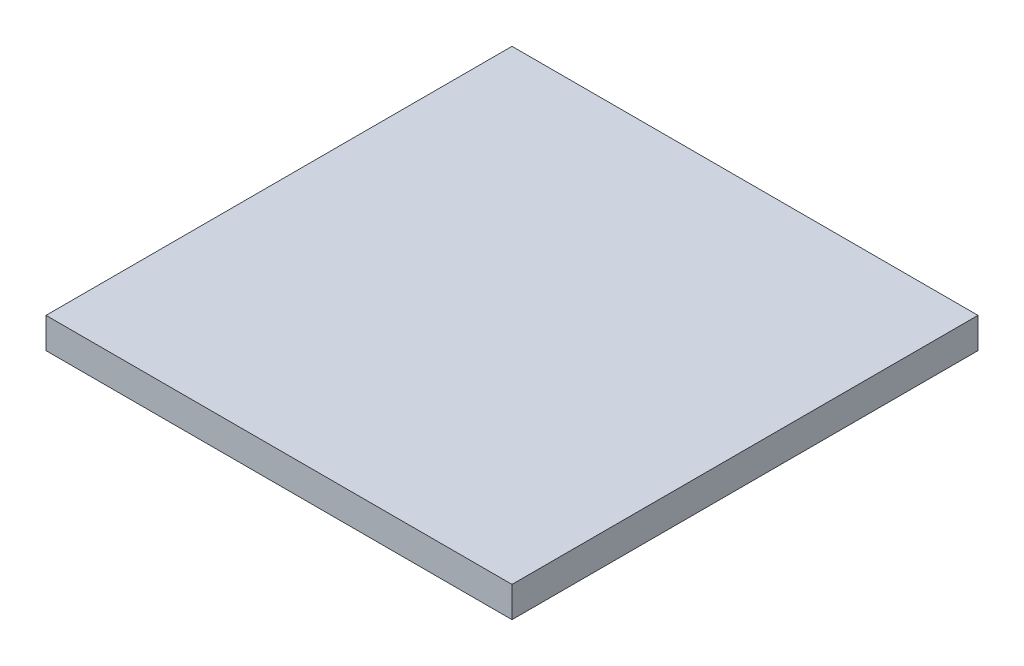
ISO-10303-21;
HEADER;
FILE_DESCRIPTION(('STEP AP214'),'2;1');
FILE_NAME('part.step','',(''),(''),'','','');
FILE_SCHEMA(('AUTOMOTIVE_DESIGN { 1 0 10303 214 1 1 1 1 }'));
ENDSEC;
DATA;
#1=APPLICATION_CONTEXT('core data for automotive mechanical design processes');
#2=APPLICATION_PROTOCOL_DEFINITION('international standard','automotive_design',2000,#1);
#3=PRODUCT_CONTEXT('',#1,'mechanical');
#4=PRODUCT('Part','Part','',(#3));
#5=PRODUCT_RELATED_PRODUCT_CATEGORY('part','',(#4));
#6=PRODUCT_DEFINITION_FORMATION('','',#4);
#7=PRODUCT_DEFINITION_CONTEXT('part definition',#1,'design');
#8=PRODUCT_DEFINITION('design','',#6,#7);
#9=PRODUCT_DEFINITION_SHAPE('','',#8);
#10=(LENGTH_UNIT() NAMED_UNIT(*) SI_UNIT(.MILLI.,.METRE.));
#11=(NAMED_UNIT(*) PLANE_ANGLE_UNIT() SI_UNIT($,.RADIAN.));
#12=(NAMED_UNIT(*) SI_UNIT($,.STERADIAN.) SOLID_ANGLE_UNIT());
#13=UNCERTAINTY_MEASURE_WITH_UNIT(LENGTH_MEASURE(1.E-05),#10,'distance_accuracy_value','');
#14=(GEOMETRIC_REPRESENTATION_CONTEXT(3) GLOBAL_UNCERTAINTY_ASSIGNED_CONTEXT((#13)) GLOBAL_UNIT_ASSIGNED_CONTEXT((#10,
#11,#12)) REPRESENTATION_CONTEXT('',''));
#15=CARTESIAN_POINT('',(0.,0.,0.));
#16=DIRECTION('',(0.,0.,1.));
#17=DIRECTION('',(1.,0.,0.));
#18=AXIS2_PLACEMENT_3D('',#15,#16,#17);
#19=CARTESIAN_POINT('',(76.2,10.,76.2));
#20=DIRECTION('',(-1.,0.,0.));
#21=DIRECTION('',(0.,0.,1.));
#22=AXIS2_PLACEMENT_3D('',#19,#20,#21);
#23=PLANE('',#22);
#24=DIRECTION('',(0.,0.,-1.));
#25=VECTOR('',#24,1.);
#26=CARTESIAN_POINT('',(76.2,0.,76.2));
#27=LINE('',#26,#25);
#28=CARTESIAN_POINT('',(76.2,0.,76.2));
#29=VERTEX_POINT('',#28);
#30=CARTESIAN_POINT('',(76.2,0.,-76.2));
#31=VERTEX_POINT('',#30);
#32=EDGE_CURVE('E100',#29,#31,#27,.T.);
#33=ORIENTED_EDGE('',*,*,#32,.T.);
#34=DIRECTION('',(0.,-1.,0.));
#35=VECTOR('',#34,1.);
#36=CARTESIAN_POINT('',(76.2,10.,-76.2));
#37=LINE('',#36,#35);
#38=CARTESIAN_POINT('',(76.2,10.,-76.2));
#39=VERTEX_POINT('',#38);
#40=EDGE_CURVE('E11',#39,#31,#37,.T.);
#41=ORIENTED_EDGE('',*,*,#40,.F.);
#42=DIRECTION('',(0.,0.,-1.));
#43=VECTOR('',#42,1.);
#44=CARTESIAN_POINT('',(76.2,10.,76.2));
#45=LINE('',#44,#43);
#46=CARTESIAN_POINT('',(76.2,10.,76.2));
#47=VERTEX_POINT('',#46);
#48=EDGE_CURVE('E88',#47,#39,#45,.T.);
#49=ORIENTED_EDGE('',*,*,#48,.F.);
#50=DIRECTION('',(0.,-1.,0.));
#51=VECTOR('',#50,1.);
#52=CARTESIAN_POINT('',(76.2,10.,76.2));
#53=LINE('',#52,#51);
#54=EDGE_CURVE('E96',#47,#29,#53,.T.);
#55=ORIENTED_EDGE('',*,*,#54,.T.);
#56=EDGE_LOOP('',(#33,#41,#49,#55));
#57=FACE_BOUND('',#56,.T.);
#58=ADVANCED_FACE('F37',(#57),#23,.F.);
#59=CARTESIAN_POINT('',(-76.2,10.,-76.2));
#60=DIRECTION('',(0.,0.,1.));
#61=DIRECTION('',(1.,0.,0.));
#62=AXIS2_PLACEMENT_3D('',#59,#60,#61);
#63=PLANE('',#62);
#64=DIRECTION('',(-1.,0.,0.));
#65=VECTOR('',#64,1.);
#66=CARTESIAN_POINT('',(-76.2,0.,-76.2));
#67=LINE('',#66,#65);
#68=CARTESIAN_POINT('',(-76.2,0.,-76.2));
#69=VERTEX_POINT('',#68);
#70=EDGE_CURVE('E92',#31,#69,#67,.T.);
#71=ORIENTED_EDGE('',*,*,#70,.T.);
#72=DIRECTION('',(0.,-1.,0.));
#73=VECTOR('',#72,1.);
#74=CARTESIAN_POINT('',(-76.2,10.,-76.2));
#75=LINE('',#74,#73);
#76=CARTESIAN_POINT('',(-76.2,10.,-76.2));
#77=VERTEX_POINT('',#76);
#78=EDGE_CURVE('E45',#77,#69,#75,.T.);
#79=ORIENTED_EDGE('',*,*,#78,.F.);
#80=DIRECTION('',(-1.,0.,0.));
#81=VECTOR('',#80,1.);
#82=CARTESIAN_POINT('',(-76.2,10.,-76.2));
#83=LINE('',#82,#81);
#84=EDGE_CURVE('E83',#39,#77,#83,.T.);
#85=ORIENTED_EDGE('',*,*,#84,.F.);
#86=ORIENTED_EDGE('',*,*,#40,.T.);
#87=EDGE_LOOP('',(#71,#79,#85,#86));
#88=FACE_BOUND('',#87,.T.);
#89=ADVANCED_FACE('F91',(#88),#63,.F.);
#90=CARTESIAN_POINT('',(-76.2,10.,76.2));
#91=DIRECTION('',(1.,0.,0.));
#92=DIRECTION('',(0.,0.,-1.));
#93=AXIS2_PLACEMENT_3D('',#90,#91,#92);
#94=PLANE('',#93);
#95=DIRECTION('',(0.,0.,1.));
#96=VECTOR('',#95,1.);
#97=CARTESIAN_POINT('',(-76.2,0.,76.2));
#98=LINE('',#97,#96);
#99=CARTESIAN_POINT('',(-76.2,0.,76.2));
#100=VERTEX_POINT('',#99);
#101=EDGE_CURVE('E70',#69,#100,#98,.T.);
#102=ORIENTED_EDGE('',*,*,#101,.T.);
#103=DIRECTION('',(0.,-1.,0.));
#104=VECTOR('',#103,1.);
#105=CARTESIAN_POINT('',(-76.2,10.,76.2));
#106=LINE('',#105,#104);
#107=CARTESIAN_POINT('',(-76.2,10.,76.2));
#108=VERTEX_POINT('',#107);
#109=EDGE_CURVE('E93',#108,#100,#106,.T.);
#110=ORIENTED_EDGE('',*,*,#109,.F.);
#111=DIRECTION('',(0.,0.,1.));
#112=VECTOR('',#111,1.);
#113=CARTESIAN_POINT('',(-76.2,10.,76.2));
#114=LINE('',#113,#112);
#115=EDGE_CURVE('E86',#77,#108,#114,.T.);
#116=ORIENTED_EDGE('',*,*,#115,.F.);
#117=ORIENTED_EDGE('',*,*,#78,.T.);
#118=EDGE_LOOP('',(#102,#110,#116,#117));
#119=FACE_BOUND('',#118,.T.);
#120=ADVANCED_FACE('F94',(#119),#94,.F.);
#121=CARTESIAN_POINT('',(-76.2,10.,76.2));
#122=DIRECTION('',(0.,0.,-1.));
#123=DIRECTION('',(-1.,0.,0.));
#124=AXIS2_PLACEMENT_3D('',#121,#122,#123);
#125=PLANE('',#124);
#126=DIRECTION('',(1.,0.,0.));
#127=VECTOR('',#126,1.);
#128=CARTESIAN_POINT('',(-76.2,0.,76.2));
#129=LINE('',#128,#127);
#130=EDGE_CURVE('E76',#100,#29,#129,.T.);
#131=ORIENTED_EDGE('',*,*,#130,.T.);
#132=ORIENTED_EDGE('',*,*,#54,.F.);
#133=DIRECTION('',(1.,0.,0.));
#134=VECTOR('',#133,1.);
#135=CARTESIAN_POINT('',(-76.2,10.,76.2));
#136=LINE('',#135,#134);
#137=EDGE_CURVE('E53',#108,#47,#136,.T.);
#138=ORIENTED_EDGE('',*,*,#137,.F.);
#139=ORIENTED_EDGE('',*,*,#109,.T.);
#140=EDGE_LOOP('',(#131,#132,#138,#139));
#141=FACE_BOUND('',#140,.T.);
#142=ADVANCED_FACE('F107',(#141),#125,.F.);
#143=CARTESIAN_POINT('',(0.,10.,0.));
#144=DIRECTION('',(0.,-1.,0.));
#145=DIRECTION('',(0.,0.,-1.));
#146=AXIS2_PLACEMENT_3D('',#143,#144,#145);
#147=PLANE('',#146);
#148=ORIENTED_EDGE('',*,*,#48,.T.);
#149=ORIENTED_EDGE('',*,*,#84,.T.);
#150=ORIENTED_EDGE('',*,*,#115,.T.);
#151=ORIENTED_EDGE('',*,*,#137,.T.);
#152=EDGE_LOOP('',(#148,#149,#150,#151));
#153=FACE_BOUND('',#152,.T.);
#154=ADVANCED_FACE('F84',(#153),#147,.F.);
#155=CARTESIAN_POINT('',(0.,0.,0.));
#156=DIRECTION('',(0.,-1.,0.));
#157=DIRECTION('',(0.,0.,-1.));
#158=AXIS2_PLACEMENT_3D('',#155,#156,#157);
#159=PLANE('',#158);
#160=ORIENTED_EDGE('',*,*,#32,.F.);
#161=ORIENTED_EDGE('',*,*,#130,.F.);
#162=ORIENTED_EDGE('',*,*,#101,.F.);
#163=ORIENTED_EDGE('',*,*,#70,.F.);
#164=EDGE_LOOP('',(#160,#161,#162,#163));
#165=FACE_BOUND('',#164,.T.);
#166=ADVANCED_FACE('F110',(#165),#159,.T.);
#167=CLOSED_SHELL('',(#58,#89,#120,#142,#154,#166));
#168=MANIFOLD_SOLID_BREP('B2',#167);
#169=ADVANCED_BREP_SHAPE_REPRESENTATION('',(#18,#168),#14);
#170=SHAPE_DEFINITION_REPRESENTATION(#9,#169);
ENDSEC;
END-ISO-10303-21;
